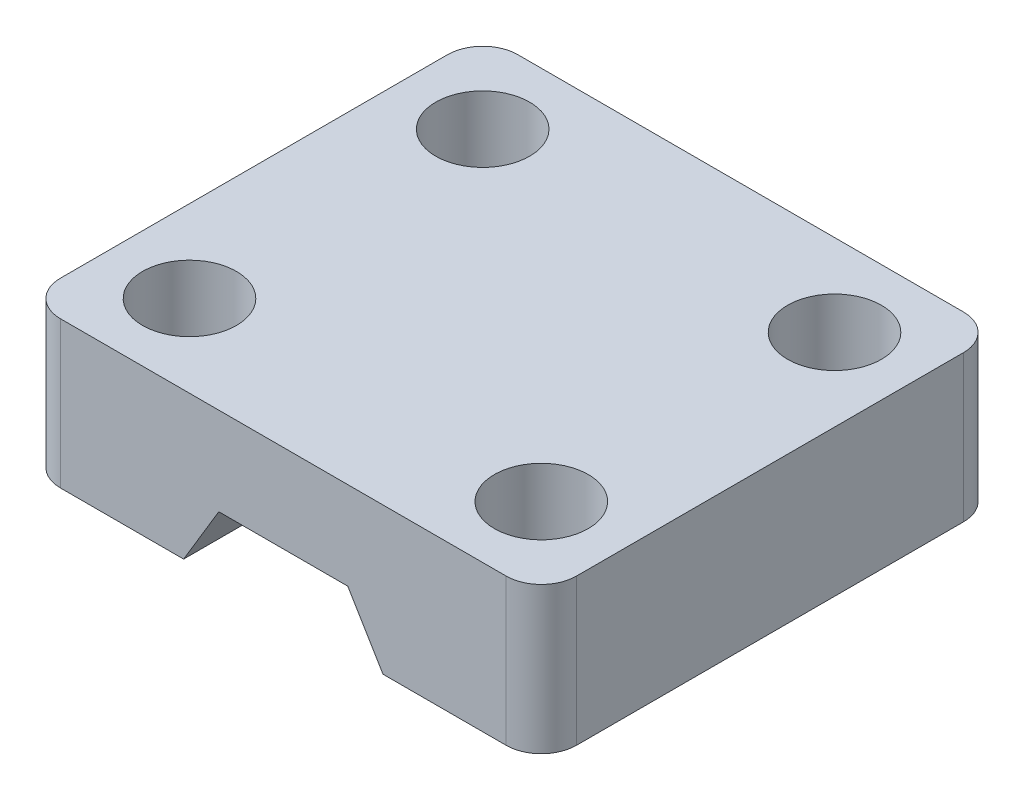
ISO-10303-21;
HEADER;
FILE_DESCRIPTION(('STEP AP214'),'2;1');
FILE_NAME('part.step','',(''),(''),'','','');
FILE_SCHEMA(('AUTOMOTIVE_DESIGN { 1 0 10303 214 1 1 1 1 }'));
ENDSEC;
DATA;
#1=APPLICATION_CONTEXT('core data for automotive mechanical design processes');
#2=APPLICATION_PROTOCOL_DEFINITION('international standard','automotive_design',2000,#1);
#3=PRODUCT_CONTEXT('',#1,'mechanical');
#4=PRODUCT('Part','Part','',(#3));
#5=PRODUCT_RELATED_PRODUCT_CATEGORY('part','',(#4));
#6=PRODUCT_DEFINITION_FORMATION('','',#4);
#7=PRODUCT_DEFINITION_CONTEXT('part definition',#1,'design');
#8=PRODUCT_DEFINITION('design','',#6,#7);
#9=PRODUCT_DEFINITION_SHAPE('','',#8);
#10=(LENGTH_UNIT() NAMED_UNIT(*) SI_UNIT(.MILLI.,.METRE.));
#11=(NAMED_UNIT(*) PLANE_ANGLE_UNIT() SI_UNIT($,.RADIAN.));
#12=(NAMED_UNIT(*) SI_UNIT($,.STERADIAN.) SOLID_ANGLE_UNIT());
#13=UNCERTAINTY_MEASURE_WITH_UNIT(LENGTH_MEASURE(1.E-05),#10,'distance_accuracy_value','');
#14=(GEOMETRIC_REPRESENTATION_CONTEXT(3) GLOBAL_UNCERTAINTY_ASSIGNED_CONTEXT((#13)) GLOBAL_UNIT_ASSIGNED_CONTEXT((#10,
#11,#12)) REPRESENTATION_CONTEXT('',''));
#15=CARTESIAN_POINT('',(0.,0.,0.));
#16=DIRECTION('',(0.,0.,1.));
#17=DIRECTION('',(1.,0.,0.));
#18=AXIS2_PLACEMENT_3D('',#15,#16,#17);
#19=CARTESIAN_POINT('',(0.,0.,39.));
#20=DIRECTION('',(1.,0.,0.));
#21=DIRECTION('',(0.,1.,0.));
#22=AXIS2_PLACEMENT_3D('',#19,#20,#21);
#23=PLANE('',#22);
#24=DIRECTION('',(0.,0.,-1.));
#25=VECTOR('',#24,1.);
#26=CARTESIAN_POINT('',(0.,0.,39.));
#27=LINE('',#26,#25);
#28=CARTESIAN_POINT('',(0.,0.,36.));
#29=VERTEX_POINT('',#28);
#30=CARTESIAN_POINT('',(0.,0.,3.));
#31=VERTEX_POINT('',#30);
#32=EDGE_CURVE('E168',#29,#31,#27,.T.);
#33=ORIENTED_EDGE('',*,*,#32,.T.);
#34=DIRECTION('',(0.,-1.,0.));
#35=VECTOR('',#34,1.);
#36=CARTESIAN_POINT('',(0.,0.,3.));
#37=LINE('',#36,#35);
#38=CARTESIAN_POINT('',(0.,-12.5,3.));
#39=VERTEX_POINT('',#38);
#40=EDGE_CURVE('E198',#31,#39,#37,.T.);
#41=ORIENTED_EDGE('',*,*,#40,.T.);
#42=DIRECTION('',(0.,0.,-1.));
#43=VECTOR('',#42,1.);
#44=CARTESIAN_POINT('',(0.,-12.5,39.));
#45=LINE('',#44,#43);
#46=CARTESIAN_POINT('',(0.,-12.5,36.));
#47=VERTEX_POINT('',#46);
#48=EDGE_CURVE('E151',#47,#39,#45,.T.);
#49=ORIENTED_EDGE('',*,*,#48,.F.);
#50=DIRECTION('',(0.,-1.,0.));
#51=VECTOR('',#50,1.);
#52=CARTESIAN_POINT('',(0.,0.,36.));
#53=LINE('',#52,#51);
#54=EDGE_CURVE('E196',#47,#29,#53,.F.);
#55=ORIENTED_EDGE('',*,*,#54,.T.);
#56=EDGE_LOOP('',(#33,#41,#49,#55));
#57=FACE_BOUND('',#56,.T.);
#58=ADVANCED_FACE('F41',(#57),#23,.F.);
#59=CARTESIAN_POINT('',(0.,-12.5,39.));
#60=DIRECTION('',(0.,1.,0.));
#61=DIRECTION('',(0.,0.,1.));
#62=AXIS2_PLACEMENT_3D('',#59,#60,#61);
#63=PLANE('',#62);
#64=CARTESIAN_POINT('',(7.,-12.5,32.));
#65=DIRECTION('',(0.,1.,0.));
#66=DIRECTION('',(0.,0.,1.));
#67=AXIS2_PLACEMENT_3D('',#64,#65,#66);
#68=CIRCLE('',#67,4.);
#69=CARTESIAN_POINT('',(7.,-12.5,36.));
#70=VERTEX_POINT('',#69);
#71=EDGE_CURVE('E325',#70,#70,#68,.T.);
#72=ORIENTED_EDGE('',*,*,#71,.T.);
#73=EDGE_LOOP('',(#72));
#74=FACE_BOUND('',#73,.T.);
#75=CARTESIAN_POINT('',(7.,-12.5,7.));
#76=DIRECTION('',(0.,1.,0.));
#77=DIRECTION('',(0.,0.,1.));
#78=AXIS2_PLACEMENT_3D('',#75,#76,#77);
#79=CIRCLE('',#78,4.);
#80=CARTESIAN_POINT('',(7.,-12.5,11.));
#81=VERTEX_POINT('',#80);
#82=EDGE_CURVE('E171',#81,#81,#79,.T.);
#83=ORIENTED_EDGE('',*,*,#82,.T.);
#84=EDGE_LOOP('',(#83));
#85=FACE_BOUND('',#84,.T.);
#86=ORIENTED_EDGE('',*,*,#48,.T.);
#87=CARTESIAN_POINT('',(3.,-12.5,3.));
#88=DIRECTION('',(0.,1.,0.));
#89=DIRECTION('',(0.,0.,1.));
#90=AXIS2_PLACEMENT_3D('',#87,#88,#89);
#91=CIRCLE('',#90,3.);
#92=CARTESIAN_POINT('',(3.,-12.5,0.));
#93=VERTEX_POINT('',#92);
#94=EDGE_CURVE('E203',#39,#93,#91,.F.);
#95=ORIENTED_EDGE('',*,*,#94,.T.);
#96=DIRECTION('',(1.,0.,0.));
#97=VECTOR('',#96,1.);
#98=CARTESIAN_POINT('',(0.,-12.5,0.));
#99=LINE('',#98,#97);
#100=CARTESIAN_POINT('',(13.5,-12.5,0.));
#101=VERTEX_POINT('',#100);
#102=EDGE_CURVE('E148',#93,#101,#99,.T.);
#103=ORIENTED_EDGE('',*,*,#102,.T.);
#104=DIRECTION('',(0.,0.,-1.));
#105=VECTOR('',#104,1.);
#106=CARTESIAN_POINT('',(13.5,-12.5,39.));
#107=LINE('',#106,#105);
#108=CARTESIAN_POINT('',(13.5,-12.5,39.));
#109=VERTEX_POINT('',#108);
#110=EDGE_CURVE('E144',#109,#101,#107,.T.);
#111=ORIENTED_EDGE('',*,*,#110,.F.);
#112=DIRECTION('',(1.,0.,0.));
#113=VECTOR('',#112,1.);
#114=CARTESIAN_POINT('',(0.,-12.5,39.));
#115=LINE('',#114,#113);
#116=CARTESIAN_POINT('',(3.,-12.5,39.));
#117=VERTEX_POINT('',#116);
#118=EDGE_CURVE('E132',#117,#109,#115,.T.);
#119=ORIENTED_EDGE('',*,*,#118,.F.);
#120=CARTESIAN_POINT('',(3.,-12.5,36.));
#121=DIRECTION('',(0.,1.,0.));
#122=DIRECTION('',(0.,0.,1.));
#123=AXIS2_PLACEMENT_3D('',#120,#121,#122);
#124=CIRCLE('',#123,3.);
#125=EDGE_CURVE('E201',#117,#47,#124,.F.);
#126=ORIENTED_EDGE('',*,*,#125,.T.);
#127=EDGE_LOOP('',(#86,#95,#103,#111,#119,#126));
#128=FACE_BOUND('',#127,.T.);
#129=ADVANCED_FACE('F146',(#74,#85,#128),#63,.F.);
#130=CARTESIAN_POINT('',(13.5,-12.5,39.));
#131=DIRECTION('',(-0.857492925712544,0.514495755427527,0.));
#132=DIRECTION('',(-0.514495755427527,-0.857492925712544,0.));
#133=AXIS2_PLACEMENT_3D('',#130,#131,#132);
#134=PLANE('',#133);
#135=DIRECTION('',(0.514495755427527,0.857492925712544,0.));
#136=VECTOR('',#135,1.);
#137=CARTESIAN_POINT('',(13.5,-12.5,0.));
#138=LINE('',#137,#136);
#139=CARTESIAN_POINT('',(16.5,-7.5,0.));
#140=VERTEX_POINT('',#139);
#141=EDGE_CURVE('E170',#101,#140,#138,.T.);
#142=ORIENTED_EDGE('',*,*,#141,.T.);
#143=DIRECTION('',(0.,0.,-1.));
#144=VECTOR('',#143,1.);
#145=CARTESIAN_POINT('',(16.5,-7.5,39.));
#146=LINE('',#145,#144);
#147=CARTESIAN_POINT('',(16.5,-7.5,39.));
#148=VERTEX_POINT('',#147);
#149=EDGE_CURVE('E152',#148,#140,#146,.T.);
#150=ORIENTED_EDGE('',*,*,#149,.F.);
#151=DIRECTION('',(0.514495755427527,0.857492925712544,0.));
#152=VECTOR('',#151,1.);
#153=CARTESIAN_POINT('',(13.5,-12.5,39.));
#154=LINE('',#153,#152);
#155=EDGE_CURVE('E136',#109,#148,#154,.T.);
#156=ORIENTED_EDGE('',*,*,#155,.F.);
#157=ORIENTED_EDGE('',*,*,#110,.T.);
#158=EDGE_LOOP('',(#142,#150,#156,#157));
#159=FACE_BOUND('',#158,.T.);
#160=ADVANCED_FACE('F154',(#159),#134,.F.);
#161=CARTESIAN_POINT('',(16.5,-7.5,39.));
#162=DIRECTION('',(0.,1.,0.));
#163=DIRECTION('',(0.,0.,1.));
#164=AXIS2_PLACEMENT_3D('',#161,#162,#163);
#165=PLANE('',#164);
#166=DIRECTION('',(1.,0.,0.));
#167=VECTOR('',#166,1.);
#168=CARTESIAN_POINT('',(16.5,-7.5,0.));
#169=LINE('',#168,#167);
#170=CARTESIAN_POINT('',(27.5,-7.5,0.));
#171=VERTEX_POINT('',#170);
#172=EDGE_CURVE('E173',#140,#171,#169,.T.);
#173=ORIENTED_EDGE('',*,*,#172,.T.);
#174=DIRECTION('',(0.,0.,-1.));
#175=VECTOR('',#174,1.);
#176=CARTESIAN_POINT('',(27.5,-7.5,39.));
#177=LINE('',#176,#175);
#178=CARTESIAN_POINT('',(27.5,-7.5,39.));
#179=VERTEX_POINT('',#178);
#180=EDGE_CURVE('E191',#179,#171,#177,.T.);
#181=ORIENTED_EDGE('',*,*,#180,.F.);
#182=DIRECTION('',(1.,0.,0.));
#183=VECTOR('',#182,1.);
#184=CARTESIAN_POINT('',(16.5,-7.5,39.));
#185=LINE('',#184,#183);
#186=EDGE_CURVE('E157',#148,#179,#185,.T.);
#187=ORIENTED_EDGE('',*,*,#186,.F.);
#188=ORIENTED_EDGE('',*,*,#149,.T.);
#189=EDGE_LOOP('',(#173,#181,#187,#188));
#190=FACE_BOUND('',#189,.T.);
#191=ADVANCED_FACE('F269',(#190),#165,.F.);
#192=CARTESIAN_POINT('',(27.5,-7.5,39.));
#193=DIRECTION('',(0.857492925712544,0.514495755427527,0.));
#194=DIRECTION('',(-0.514495755427527,0.857492925712544,0.));
#195=AXIS2_PLACEMENT_3D('',#192,#193,#194);
#196=PLANE('',#195);
#197=DIRECTION('',(0.514495755427527,-0.857492925712544,0.));
#198=VECTOR('',#197,1.);
#199=CARTESIAN_POINT('',(27.5,-7.5,0.));
#200=LINE('',#199,#198);
#201=CARTESIAN_POINT('',(30.5,-12.5,0.));
#202=VERTEX_POINT('',#201);
#203=EDGE_CURVE('E175',#171,#202,#200,.T.);
#204=ORIENTED_EDGE('',*,*,#203,.T.);
#205=DIRECTION('',(0.,0.,-1.));
#206=VECTOR('',#205,1.);
#207=CARTESIAN_POINT('',(30.5,-12.5,39.));
#208=LINE('',#207,#206);
#209=CARTESIAN_POINT('',(30.5,-12.5,39.));
#210=VERTEX_POINT('',#209);
#211=EDGE_CURVE('E188',#210,#202,#208,.T.);
#212=ORIENTED_EDGE('',*,*,#211,.F.);
#213=DIRECTION('',(0.514495755427527,-0.857492925712544,0.));
#214=VECTOR('',#213,1.);
#215=CARTESIAN_POINT('',(27.5,-7.5,39.));
#216=LINE('',#215,#214);
#217=EDGE_CURVE('E159',#179,#210,#216,.T.);
#218=ORIENTED_EDGE('',*,*,#217,.F.);
#219=ORIENTED_EDGE('',*,*,#180,.T.);
#220=EDGE_LOOP('',(#204,#212,#218,#219));
#221=FACE_BOUND('',#220,.T.);
#222=ADVANCED_FACE('F272',(#221),#196,.F.);
#223=CARTESIAN_POINT('',(30.5,-12.5,39.));
#224=DIRECTION('',(0.,1.,0.));
#225=DIRECTION('',(-1.,0.,0.));
#226=AXIS2_PLACEMENT_3D('',#223,#224,#225);
#227=PLANE('',#226);
#228=CARTESIAN_POINT('',(37.,-12.5,32.));
#229=DIRECTION('',(0.,1.,0.));
#230=DIRECTION('',(0.,0.,1.));
#231=AXIS2_PLACEMENT_3D('',#228,#229,#230);
#232=CIRCLE('',#231,4.00000000000001);
#233=CARTESIAN_POINT('',(37.,-12.5,36.));
#234=VERTEX_POINT('',#233);
#235=EDGE_CURVE('E319',#234,#234,#232,.T.);
#236=ORIENTED_EDGE('',*,*,#235,.T.);
#237=EDGE_LOOP('',(#236));
#238=FACE_BOUND('',#237,.T.);
#239=CARTESIAN_POINT('',(37.,-12.5,7.));
#240=DIRECTION('',(0.,1.,0.));
#241=DIRECTION('',(0.,0.,1.));
#242=AXIS2_PLACEMENT_3D('',#239,#240,#241);
#243=CIRCLE('',#242,4.00000000000001);
#244=CARTESIAN_POINT('',(37.,-12.5,11.));
#245=VERTEX_POINT('',#244);
#246=EDGE_CURVE('E306',#245,#245,#243,.T.);
#247=ORIENTED_EDGE('',*,*,#246,.T.);
#248=EDGE_LOOP('',(#247));
#249=FACE_BOUND('',#248,.T.);
#250=DIRECTION('',(1.,0.,0.));
#251=VECTOR('',#250,1.);
#252=CARTESIAN_POINT('',(30.5,-12.5,0.));
#253=LINE('',#252,#251);
#254=CARTESIAN_POINT('',(41.,-12.5,0.));
#255=VERTEX_POINT('',#254);
#256=EDGE_CURVE('E177',#202,#255,#253,.T.);
#257=ORIENTED_EDGE('',*,*,#256,.T.);
#258=CARTESIAN_POINT('',(41.,-12.5,3.));
#259=DIRECTION('',(0.,1.,0.));
#260=DIRECTION('',(-1.,0.,0.));
#261=AXIS2_PLACEMENT_3D('',#258,#259,#260);
#262=CIRCLE('',#261,3.);
#263=CARTESIAN_POINT('',(44.,-12.5,3.));
#264=VERTEX_POINT('',#263);
#265=EDGE_CURVE('E62',#255,#264,#262,.F.);
#266=ORIENTED_EDGE('',*,*,#265,.T.);
#267=DIRECTION('',(0.,0.,-1.));
#268=VECTOR('',#267,1.);
#269=CARTESIAN_POINT('',(44.,-12.5,39.));
#270=LINE('',#269,#268);
#271=CARTESIAN_POINT('',(44.,-12.5,36.));
#272=VERTEX_POINT('',#271);
#273=EDGE_CURVE('E186',#272,#264,#270,.T.);
#274=ORIENTED_EDGE('',*,*,#273,.F.);
#275=CARTESIAN_POINT('',(41.,-12.5,36.));
#276=DIRECTION('',(0.,1.,0.));
#277=DIRECTION('',(-1.,0.,0.));
#278=AXIS2_PLACEMENT_3D('',#275,#276,#277);
#279=CIRCLE('',#278,3.);
#280=CARTESIAN_POINT('',(41.,-12.5,39.));
#281=VERTEX_POINT('',#280);
#282=EDGE_CURVE('E56',#272,#281,#279,.F.);
#283=ORIENTED_EDGE('',*,*,#282,.T.);
#284=DIRECTION('',(1.,0.,0.));
#285=VECTOR('',#284,1.);
#286=CARTESIAN_POINT('',(30.5,-12.5,39.));
#287=LINE('',#286,#285);
#288=EDGE_CURVE('E164',#210,#281,#287,.T.);
#289=ORIENTED_EDGE('',*,*,#288,.F.);
#290=ORIENTED_EDGE('',*,*,#211,.T.);
#291=EDGE_LOOP('',(#257,#266,#274,#283,#289,#290));
#292=FACE_BOUND('',#291,.T.);
#293=ADVANCED_FACE('F238',(#238,#249,#292),#227,.F.);
#294=CARTESIAN_POINT('',(44.,0.,39.));
#295=DIRECTION('',(-1.,0.,0.));
#296=DIRECTION('',(0.,0.,1.));
#297=AXIS2_PLACEMENT_3D('',#294,#295,#296);
#298=PLANE('',#297);
#299=ORIENTED_EDGE('',*,*,#273,.T.);
#300=DIRECTION('',(0.,1.,0.));
#301=VECTOR('',#300,1.);
#302=CARTESIAN_POINT('',(44.,0.,3.));
#303=LINE('',#302,#301);
#304=CARTESIAN_POINT('',(44.,0.,3.));
#305=VERTEX_POINT('',#304);
#306=EDGE_CURVE('E219',#264,#305,#303,.T.);
#307=ORIENTED_EDGE('',*,*,#306,.T.);
#308=DIRECTION('',(0.,0.,-1.));
#309=VECTOR('',#308,1.);
#310=CARTESIAN_POINT('',(44.,0.,39.));
#311=LINE('',#310,#309);
#312=CARTESIAN_POINT('',(44.,0.,36.));
#313=VERTEX_POINT('',#312);
#314=EDGE_CURVE('E183',#313,#305,#311,.T.);
#315=ORIENTED_EDGE('',*,*,#314,.F.);
#316=DIRECTION('',(0.,1.,0.));
#317=VECTOR('',#316,1.);
#318=CARTESIAN_POINT('',(44.,-12.5,36.));
#319=LINE('',#318,#317);
#320=EDGE_CURVE('E217',#313,#272,#319,.F.);
#321=ORIENTED_EDGE('',*,*,#320,.T.);
#322=EDGE_LOOP('',(#299,#307,#315,#321));
#323=FACE_BOUND('',#322,.T.);
#324=ADVANCED_FACE('F226',(#323),#298,.F.);
#325=CARTESIAN_POINT('',(0.,0.,39.));
#326=DIRECTION('',(0.,-1.,0.));
#327=DIRECTION('',(0.,0.,-1.));
#328=AXIS2_PLACEMENT_3D('',#325,#326,#327);
#329=PLANE('',#328);
#330=CARTESIAN_POINT('',(7.,0.,32.));
#331=DIRECTION('',(0.,1.,0.));
#332=DIRECTION('',(0.,0.,1.));
#333=AXIS2_PLACEMENT_3D('',#330,#331,#332);
#334=CIRCLE('',#333,4.);
#335=CARTESIAN_POINT('',(7.,0.,36.));
#336=VERTEX_POINT('',#335);
#337=EDGE_CURVE('E322',#336,#336,#334,.T.);
#338=ORIENTED_EDGE('',*,*,#337,.F.);
#339=EDGE_LOOP('',(#338));
#340=FACE_BOUND('',#339,.T.);
#341=CARTESIAN_POINT('',(37.,0.,32.));
#342=DIRECTION('',(0.,1.,0.));
#343=DIRECTION('',(0.,0.,1.));
#344=AXIS2_PLACEMENT_3D('',#341,#342,#343);
#345=CIRCLE('',#344,4.00000000000001);
#346=CARTESIAN_POINT('',(37.,0.,36.));
#347=VERTEX_POINT('',#346);
#348=EDGE_CURVE('E314',#347,#347,#345,.T.);
#349=ORIENTED_EDGE('',*,*,#348,.F.);
#350=EDGE_LOOP('',(#349));
#351=FACE_BOUND('',#350,.T.);
#352=CARTESIAN_POINT('',(37.,0.,7.));
#353=DIRECTION('',(0.,1.,0.));
#354=DIRECTION('',(0.,0.,1.));
#355=AXIS2_PLACEMENT_3D('',#352,#353,#354);
#356=CIRCLE('',#355,4.00000000000001);
#357=CARTESIAN_POINT('',(37.,0.,11.));
#358=VERTEX_POINT('',#357);
#359=EDGE_CURVE('E309',#358,#358,#356,.T.);
#360=ORIENTED_EDGE('',*,*,#359,.F.);
#361=EDGE_LOOP('',(#360));
#362=FACE_BOUND('',#361,.T.);
#363=CARTESIAN_POINT('',(7.,0.,7.));
#364=DIRECTION('',(0.,1.,0.));
#365=DIRECTION('',(0.,0.,1.));
#366=AXIS2_PLACEMENT_3D('',#363,#364,#365);
#367=CIRCLE('',#366,4.);
#368=CARTESIAN_POINT('',(7.,0.,11.));
#369=VERTEX_POINT('',#368);
#370=EDGE_CURVE('E311',#369,#369,#367,.T.);
#371=ORIENTED_EDGE('',*,*,#370,.F.);
#372=EDGE_LOOP('',(#371));
#373=FACE_BOUND('',#372,.T.);
#374=DIRECTION('',(-1.,0.,0.));
#375=VECTOR('',#374,1.);
#376=CARTESIAN_POINT('',(0.,0.,0.));
#377=LINE('',#376,#375);
#378=CARTESIAN_POINT('',(41.,0.,0.));
#379=VERTEX_POINT('',#378);
#380=CARTESIAN_POINT('',(3.,0.,0.));
#381=VERTEX_POINT('',#380);
#382=EDGE_CURVE('E141',#379,#381,#377,.T.);
#383=ORIENTED_EDGE('',*,*,#382,.T.);
#384=CARTESIAN_POINT('',(3.,0.,3.));
#385=DIRECTION('',(0.,-1.,0.));
#386=DIRECTION('',(0.,0.,-1.));
#387=AXIS2_PLACEMENT_3D('',#384,#385,#386);
#388=CIRCLE('',#387,3.);
#389=EDGE_CURVE('E215',#381,#31,#388,.F.);
#390=ORIENTED_EDGE('',*,*,#389,.T.);
#391=ORIENTED_EDGE('',*,*,#32,.F.);
#392=CARTESIAN_POINT('',(3.,0.,36.));
#393=DIRECTION('',(0.,-1.,0.));
#394=DIRECTION('',(0.,0.,-1.));
#395=AXIS2_PLACEMENT_3D('',#392,#393,#394);
#396=CIRCLE('',#395,3.);
#397=CARTESIAN_POINT('',(3.,0.,39.));
#398=VERTEX_POINT('',#397);
#399=EDGE_CURVE('E209',#29,#398,#396,.F.);
#400=ORIENTED_EDGE('',*,*,#399,.T.);
#401=DIRECTION('',(-1.,0.,0.));
#402=VECTOR('',#401,1.);
#403=CARTESIAN_POINT('',(0.,0.,39.));
#404=LINE('',#403,#402);
#405=CARTESIAN_POINT('',(41.,0.,39.));
#406=VERTEX_POINT('',#405);
#407=EDGE_CURVE('E166',#406,#398,#404,.T.);
#408=ORIENTED_EDGE('',*,*,#407,.F.);
#409=CARTESIAN_POINT('',(41.,0.,36.));
#410=DIRECTION('',(0.,-1.,0.));
#411=DIRECTION('',(0.,0.,-1.));
#412=AXIS2_PLACEMENT_3D('',#409,#410,#411);
#413=CIRCLE('',#412,3.);
#414=EDGE_CURVE('E211',#406,#313,#413,.F.);
#415=ORIENTED_EDGE('',*,*,#414,.T.);
#416=ORIENTED_EDGE('',*,*,#314,.T.);
#417=CARTESIAN_POINT('',(41.,0.,3.));
#418=DIRECTION('',(0.,-1.,0.));
#419=DIRECTION('',(0.,0.,-1.));
#420=AXIS2_PLACEMENT_3D('',#417,#418,#419);
#421=CIRCLE('',#420,3.);
#422=EDGE_CURVE('E213',#305,#379,#421,.F.);
#423=ORIENTED_EDGE('',*,*,#422,.T.);
#424=EDGE_LOOP('',(#383,#390,#391,#400,#408,#415,#416,#423));
#425=FACE_BOUND('',#424,.T.);
#426=ADVANCED_FACE('F230',(#340,#351,#362,#373,#425),#329,.F.);
#427=CARTESIAN_POINT('',(0.,0.,39.));
#428=DIRECTION('',(0.,0.,1.));
#429=DIRECTION('',(1.,0.,0.));
#430=AXIS2_PLACEMENT_3D('',#427,#428,#429);
#431=PLANE('',#430);
#432=ORIENTED_EDGE('',*,*,#288,.T.);
#433=DIRECTION('',(0.,1.,0.));
#434=VECTOR('',#433,1.);
#435=CARTESIAN_POINT('',(41.,0.,39.));
#436=LINE('',#435,#434);
#437=EDGE_CURVE('E11',#281,#406,#436,.T.);
#438=ORIENTED_EDGE('',*,*,#437,.T.);
#439=ORIENTED_EDGE('',*,*,#407,.T.);
#440=DIRECTION('',(0.,-1.,0.));
#441=VECTOR('',#440,1.);
#442=CARTESIAN_POINT('',(3.,-12.5,39.));
#443=LINE('',#442,#441);
#444=EDGE_CURVE('E49',#398,#117,#443,.T.);
#445=ORIENTED_EDGE('',*,*,#444,.T.);
#446=ORIENTED_EDGE('',*,*,#118,.T.);
#447=ORIENTED_EDGE('',*,*,#155,.T.);
#448=ORIENTED_EDGE('',*,*,#186,.T.);
#449=ORIENTED_EDGE('',*,*,#217,.T.);
#450=EDGE_LOOP('',(#432,#438,#439,#445,#446,#447,#448,#449));
#451=FACE_BOUND('',#450,.T.);
#452=ADVANCED_FACE('F134',(#451),#431,.T.);
#453=CARTESIAN_POINT('',(0.,0.,0.));
#454=DIRECTION('',(0.,0.,1.));
#455=DIRECTION('',(1.,0.,0.));
#456=AXIS2_PLACEMENT_3D('',#453,#454,#455);
#457=PLANE('',#456);
#458=ORIENTED_EDGE('',*,*,#102,.F.);
#459=DIRECTION('',(0.,-1.,0.));
#460=VECTOR('',#459,1.);
#461=CARTESIAN_POINT('',(3.,0.,0.));
#462=LINE('',#461,#460);
#463=EDGE_CURVE('E207',#93,#381,#462,.F.);
#464=ORIENTED_EDGE('',*,*,#463,.T.);
#465=ORIENTED_EDGE('',*,*,#382,.F.);
#466=DIRECTION('',(0.,1.,0.));
#467=VECTOR('',#466,1.);
#468=CARTESIAN_POINT('',(41.,0.,0.));
#469=LINE('',#468,#467);
#470=EDGE_CURVE('E205',#379,#255,#469,.F.);
#471=ORIENTED_EDGE('',*,*,#470,.T.);
#472=ORIENTED_EDGE('',*,*,#256,.F.);
#473=ORIENTED_EDGE('',*,*,#203,.F.);
#474=ORIENTED_EDGE('',*,*,#172,.F.);
#475=ORIENTED_EDGE('',*,*,#141,.F.);
#476=EDGE_LOOP('',(#458,#464,#465,#471,#472,#473,#474,#475));
#477=FACE_BOUND('',#476,.T.);
#478=ADVANCED_FACE('F243',(#477),#457,.F.);
#479=CARTESIAN_POINT('',(7.,-12.5,7.));
#480=DIRECTION('',(0.,1.,0.));
#481=DIRECTION('',(0.,0.,1.));
#482=AXIS2_PLACEMENT_3D('',#479,#480,#481);
#483=CYLINDRICAL_SURFACE('',#482,4.);
#484=ORIENTED_EDGE('',*,*,#82,.F.);
#485=EDGE_LOOP('',(#484));
#486=FACE_BOUND('',#485,.T.);
#487=ORIENTED_EDGE('',*,*,#370,.T.);
#488=EDGE_LOOP('',(#487));
#489=FACE_BOUND('',#488,.T.);
#490=ADVANCED_FACE('F286',(#486,#489),#483,.F.);
#491=CARTESIAN_POINT('',(37.,-12.5,7.));
#492=DIRECTION('',(0.,1.,0.));
#493=DIRECTION('',(0.,0.,1.));
#494=AXIS2_PLACEMENT_3D('',#491,#492,#493);
#495=CYLINDRICAL_SURFACE('',#494,4.00000000000001);
#496=ORIENTED_EDGE('',*,*,#246,.F.);
#497=EDGE_LOOP('',(#496));
#498=FACE_BOUND('',#497,.T.);
#499=ORIENTED_EDGE('',*,*,#359,.T.);
#500=EDGE_LOOP('',(#499));
#501=FACE_BOUND('',#500,.T.);
#502=ADVANCED_FACE('F291',(#498,#501),#495,.F.);
#503=CARTESIAN_POINT('',(37.,-12.5,32.));
#504=DIRECTION('',(0.,1.,0.));
#505=DIRECTION('',(0.,0.,1.));
#506=AXIS2_PLACEMENT_3D('',#503,#504,#505);
#507=CYLINDRICAL_SURFACE('',#506,4.00000000000001);
#508=ORIENTED_EDGE('',*,*,#235,.F.);
#509=EDGE_LOOP('',(#508));
#510=FACE_BOUND('',#509,.T.);
#511=ORIENTED_EDGE('',*,*,#348,.T.);
#512=EDGE_LOOP('',(#511));
#513=FACE_BOUND('',#512,.T.);
#514=ADVANCED_FACE('F294',(#510,#513),#507,.F.);
#515=CARTESIAN_POINT('',(7.,-12.5,32.));
#516=DIRECTION('',(0.,1.,0.));
#517=DIRECTION('',(0.,0.,1.));
#518=AXIS2_PLACEMENT_3D('',#515,#516,#517);
#519=CYLINDRICAL_SURFACE('',#518,4.);
#520=ORIENTED_EDGE('',*,*,#71,.F.);
#521=EDGE_LOOP('',(#520));
#522=FACE_BOUND('',#521,.T.);
#523=ORIENTED_EDGE('',*,*,#337,.T.);
#524=EDGE_LOOP('',(#523));
#525=FACE_BOUND('',#524,.T.);
#526=ADVANCED_FACE('F254',(#522,#525),#519,.F.);
#527=CARTESIAN_POINT('',(3.,0.,3.));
#528=DIRECTION('',(0.,-1.,0.));
#529=DIRECTION('',(1.,0.,0.));
#530=AXIS2_PLACEMENT_3D('',#527,#528,#529);
#531=CYLINDRICAL_SURFACE('',#530,3.);
#532=ORIENTED_EDGE('',*,*,#389,.F.);
#533=ORIENTED_EDGE('',*,*,#463,.F.);
#534=ORIENTED_EDGE('',*,*,#94,.F.);
#535=ORIENTED_EDGE('',*,*,#40,.F.);
#536=EDGE_LOOP('',(#532,#533,#534,#535));
#537=FACE_BOUND('',#536,.T.);
#538=ADVANCED_FACE('F248',(#537),#531,.T.);
#539=CARTESIAN_POINT('',(41.,0.,3.));
#540=DIRECTION('',(0.,1.,0.));
#541=DIRECTION('',(0.,0.,1.));
#542=AXIS2_PLACEMENT_3D('',#539,#540,#541);
#543=CYLINDRICAL_SURFACE('',#542,3.);
#544=ORIENTED_EDGE('',*,*,#265,.F.);
#545=ORIENTED_EDGE('',*,*,#470,.F.);
#546=ORIENTED_EDGE('',*,*,#422,.F.);
#547=ORIENTED_EDGE('',*,*,#306,.F.);
#548=EDGE_LOOP('',(#544,#545,#546,#547));
#549=FACE_BOUND('',#548,.T.);
#550=ADVANCED_FACE('F246',(#549),#543,.T.);
#551=CARTESIAN_POINT('',(41.,0.,36.));
#552=DIRECTION('',(0.,-1.,0.));
#553=DIRECTION('',(0.,0.,-1.));
#554=AXIS2_PLACEMENT_3D('',#551,#552,#553);
#555=CYLINDRICAL_SURFACE('',#554,3.);
#556=ORIENTED_EDGE('',*,*,#282,.F.);
#557=ORIENTED_EDGE('',*,*,#320,.F.);
#558=ORIENTED_EDGE('',*,*,#414,.F.);
#559=ORIENTED_EDGE('',*,*,#437,.F.);
#560=EDGE_LOOP('',(#556,#557,#558,#559));
#561=FACE_BOUND('',#560,.T.);
#562=ADVANCED_FACE('F235',(#561),#555,.T.);
#563=CARTESIAN_POINT('',(3.,0.,36.));
#564=DIRECTION('',(0.,1.,0.));
#565=DIRECTION('',(-1.,0.,0.));
#566=AXIS2_PLACEMENT_3D('',#563,#564,#565);
#567=CYLINDRICAL_SURFACE('',#566,3.);
#568=ORIENTED_EDGE('',*,*,#399,.F.);
#569=ORIENTED_EDGE('',*,*,#54,.F.);
#570=ORIENTED_EDGE('',*,*,#125,.F.);
#571=ORIENTED_EDGE('',*,*,#444,.F.);
#572=EDGE_LOOP('',(#568,#569,#570,#571));
#573=FACE_BOUND('',#572,.T.);
#574=ADVANCED_FACE('F43',(#573),#567,.T.);
#575=CLOSED_SHELL('',(#58,#129,#160,#191,#222,#293,#324,#426,#452,#478,#490,#502,#514,#526,#538,
#550,#562,#574));
#576=MANIFOLD_SOLID_BREP('B2',#575);
#577=ADVANCED_BREP_SHAPE_REPRESENTATION('',(#18,#576),#14);
#578=SHAPE_DEFINITION_REPRESENTATION(#9,#577);
ENDSEC;
END-ISO-10303-21;
